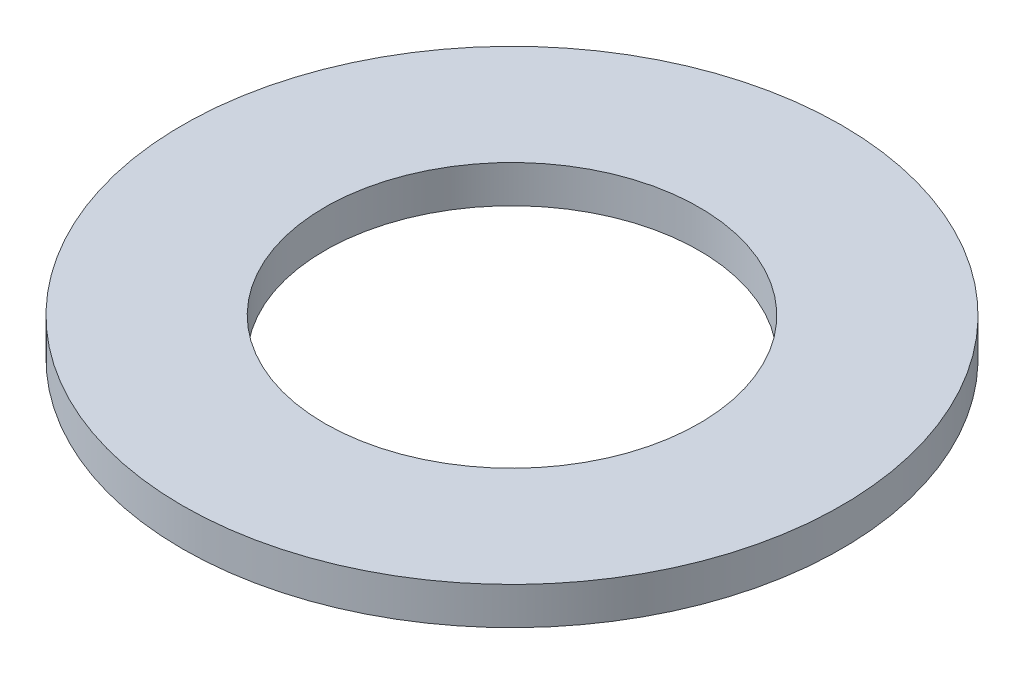
ISO-10303-21;
HEADER;
FILE_DESCRIPTION(('STEP AP214'),'2;1');
FILE_NAME('part.step','',(''),(''),'','','');
FILE_SCHEMA(('AUTOMOTIVE_DESIGN { 1 0 10303 214 1 1 1 1 }'));
ENDSEC;
DATA;
#1=APPLICATION_CONTEXT('core data for automotive mechanical design processes');
#2=APPLICATION_PROTOCOL_DEFINITION('international standard','automotive_design',2000,#1);
#3=PRODUCT_CONTEXT('',#1,'mechanical');
#4=PRODUCT('Part','Part','',(#3));
#5=PRODUCT_RELATED_PRODUCT_CATEGORY('part','',(#4));
#6=PRODUCT_DEFINITION_FORMATION('','',#4);
#7=PRODUCT_DEFINITION_CONTEXT('part definition',#1,'design');
#8=PRODUCT_DEFINITION('design','',#6,#7);
#9=PRODUCT_DEFINITION_SHAPE('','',#8);
#10=(LENGTH_UNIT() NAMED_UNIT(*) SI_UNIT(.MILLI.,.METRE.));
#11=(NAMED_UNIT(*) PLANE_ANGLE_UNIT() SI_UNIT($,.RADIAN.));
#12=(NAMED_UNIT(*) SI_UNIT($,.STERADIAN.) SOLID_ANGLE_UNIT());
#13=UNCERTAINTY_MEASURE_WITH_UNIT(LENGTH_MEASURE(1.E-05),#10,'distance_accuracy_value','');
#14=(GEOMETRIC_REPRESENTATION_CONTEXT(3) GLOBAL_UNCERTAINTY_ASSIGNED_CONTEXT((#13)) GLOBAL_UNIT_ASSIGNED_CONTEXT((#10,
#11,#12)) REPRESENTATION_CONTEXT('',''));
#15=CARTESIAN_POINT('',(0.,0.,0.));
#16=DIRECTION('',(0.,0.,1.));
#17=DIRECTION('',(1.,0.,0.));
#18=AXIS2_PLACEMENT_3D('',#15,#16,#17);
#19=CARTESIAN_POINT('',(0.,2.5,0.));
#20=DIRECTION('',(0.,1.,0.));
#21=DIRECTION('',(0.,0.,1.));
#22=AXIS2_PLACEMENT_3D('',#19,#20,#21);
#23=PLANE('',#22);
#24=CARTESIAN_POINT('',(0.,2.5,0.));
#25=DIRECTION('',(0.,1.,0.));
#26=DIRECTION('',(0.,0.,1.));
#27=AXIS2_PLACEMENT_3D('',#24,#25,#26);
#28=CIRCLE('',#27,22.);
#29=CARTESIAN_POINT('',(0.,2.5,22.));
#30=VERTEX_POINT('',#29);
#31=EDGE_CURVE('E11',#30,#30,#28,.T.);
#32=ORIENTED_EDGE('',*,*,#31,.T.);
#33=EDGE_LOOP('',(#32));
#34=FACE_BOUND('',#33,.T.);
#35=CARTESIAN_POINT('',(0.,2.5,0.));
#36=DIRECTION('',(0.,1.,0.));
#37=DIRECTION('',(0.,0.,1.));
#38=AXIS2_PLACEMENT_3D('',#35,#36,#37);
#39=CIRCLE('',#38,12.5);
#40=CARTESIAN_POINT('',(0.,2.5,12.5));
#41=VERTEX_POINT('',#40);
#42=EDGE_CURVE('E48',#41,#41,#39,.T.);
#43=ORIENTED_EDGE('',*,*,#42,.F.);
#44=EDGE_LOOP('',(#43));
#45=FACE_BOUND('',#44,.T.);
#46=ADVANCED_FACE('F37',(#34,#45),#23,.T.);
#47=CARTESIAN_POINT('',(0.,0.,0.));
#48=DIRECTION('',(0.,1.,0.));
#49=DIRECTION('',(0.,0.,1.));
#50=AXIS2_PLACEMENT_3D('',#47,#48,#49);
#51=PLANE('',#50);
#52=CARTESIAN_POINT('',(0.,0.,0.));
#53=DIRECTION('',(0.,1.,0.));
#54=DIRECTION('',(0.,0.,1.));
#55=AXIS2_PLACEMENT_3D('',#52,#53,#54);
#56=CIRCLE('',#55,22.);
#57=CARTESIAN_POINT('',(0.,0.,22.));
#58=VERTEX_POINT('',#57);
#59=EDGE_CURVE('E41',#58,#58,#56,.T.);
#60=ORIENTED_EDGE('',*,*,#59,.F.);
#61=EDGE_LOOP('',(#60));
#62=FACE_BOUND('',#61,.T.);
#63=CARTESIAN_POINT('',(0.,0.,0.));
#64=DIRECTION('',(0.,1.,0.));
#65=DIRECTION('',(0.,0.,1.));
#66=AXIS2_PLACEMENT_3D('',#63,#64,#65);
#67=CIRCLE('',#66,12.5);
#68=CARTESIAN_POINT('',(0.,0.,12.5));
#69=VERTEX_POINT('',#68);
#70=EDGE_CURVE('E50',#69,#69,#67,.T.);
#71=ORIENTED_EDGE('',*,*,#70,.T.);
#72=EDGE_LOOP('',(#71));
#73=FACE_BOUND('',#72,.T.);
#74=ADVANCED_FACE('F60',(#62,#73),#51,.F.);
#75=CARTESIAN_POINT('',(0.,2.5,0.));
#76=DIRECTION('',(0.,-1.,0.));
#77=DIRECTION('',(0.,0.,-1.));
#78=AXIS2_PLACEMENT_3D('',#75,#76,#77);
#79=CYLINDRICAL_SURFACE('',#78,22.);
#80=ORIENTED_EDGE('',*,*,#31,.F.);
#81=EDGE_LOOP('',(#80));
#82=FACE_BOUND('',#81,.T.);
#83=ORIENTED_EDGE('',*,*,#59,.T.);
#84=EDGE_LOOP('',(#83));
#85=FACE_BOUND('',#84,.T.);
#86=ADVANCED_FACE('F39',(#82,#85),#79,.T.);
#87=CARTESIAN_POINT('',(0.,2.5,0.));
#88=DIRECTION('',(0.,-1.,0.));
#89=DIRECTION('',(0.,0.,-1.));
#90=AXIS2_PLACEMENT_3D('',#87,#88,#89);
#91=CYLINDRICAL_SURFACE('',#90,12.5);
#92=ORIENTED_EDGE('',*,*,#42,.T.);
#93=EDGE_LOOP('',(#92));
#94=FACE_BOUND('',#93,.T.);
#95=ORIENTED_EDGE('',*,*,#70,.F.);
#96=EDGE_LOOP('',(#95));
#97=FACE_BOUND('',#96,.T.);
#98=ADVANCED_FACE('F56',(#94,#97),#91,.F.);
#99=CLOSED_SHELL('',(#46,#74,#86,#98));
#100=MANIFOLD_SOLID_BREP('B2',#99);
#101=ADVANCED_BREP_SHAPE_REPRESENTATION('',(#18,#100),#14);
#102=SHAPE_DEFINITION_REPRESENTATION(#9,#101);
ENDSEC;
END-ISO-10303-21;
